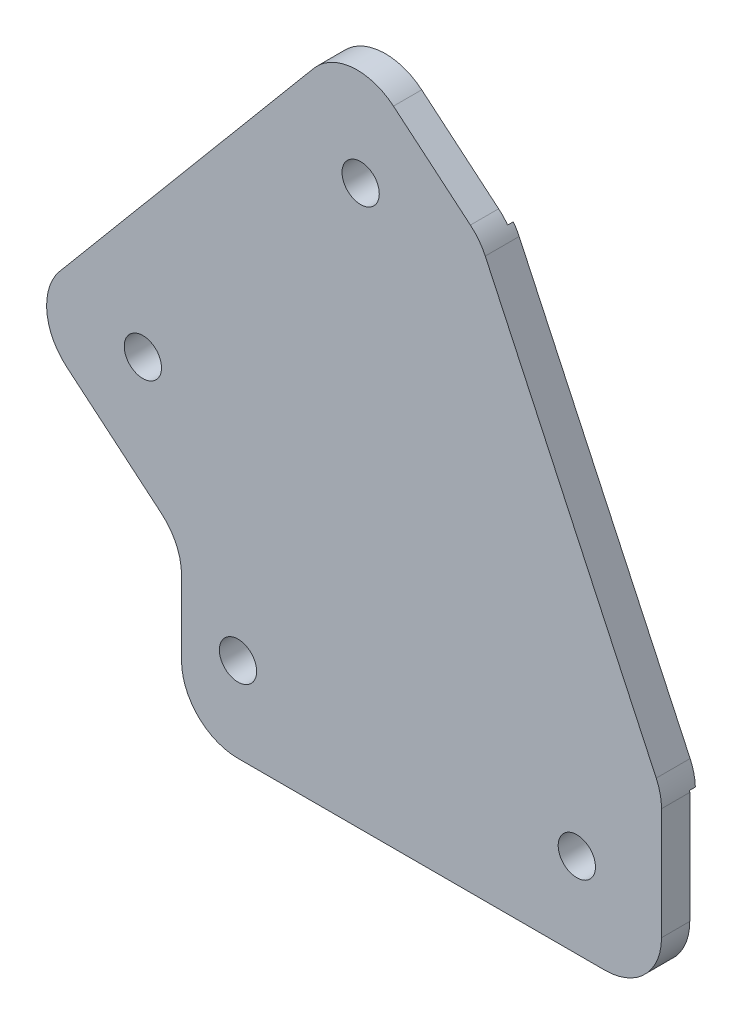
ISO-10303-21;
HEADER;
FILE_DESCRIPTION(('STEP AP214'),'2;1');
FILE_NAME('part.step','',(''),(''),'','','');
FILE_SCHEMA(('AUTOMOTIVE_DESIGN { 1 0 10303 214 1 1 1 1 }'));
ENDSEC;
DATA;
#1=APPLICATION_CONTEXT('core data for automotive mechanical design processes');
#2=APPLICATION_PROTOCOL_DEFINITION('international standard','automotive_design',2000,#1);
#3=PRODUCT_CONTEXT('',#1,'mechanical');
#4=PRODUCT('Part','Part','',(#3));
#5=PRODUCT_RELATED_PRODUCT_CATEGORY('part','',(#4));
#6=PRODUCT_DEFINITION_FORMATION('','',#4);
#7=PRODUCT_DEFINITION_CONTEXT('part definition',#1,'design');
#8=PRODUCT_DEFINITION('design','',#6,#7);
#9=PRODUCT_DEFINITION_SHAPE('','',#8);
#10=(LENGTH_UNIT() NAMED_UNIT(*) SI_UNIT(.MILLI.,.METRE.));
#11=(NAMED_UNIT(*) PLANE_ANGLE_UNIT() SI_UNIT($,.RADIAN.));
#12=(NAMED_UNIT(*) SI_UNIT($,.STERADIAN.) SOLID_ANGLE_UNIT());
#13=UNCERTAINTY_MEASURE_WITH_UNIT(LENGTH_MEASURE(1.E-05),#10,'distance_accuracy_value','');
#14=(GEOMETRIC_REPRESENTATION_CONTEXT(3) GLOBAL_UNCERTAINTY_ASSIGNED_CONTEXT((#13)) GLOBAL_UNIT_ASSIGNED_CONTEXT((#10,
#11,#12)) REPRESENTATION_CONTEXT('',''));
#15=CARTESIAN_POINT('',(0.,0.,0.));
#16=DIRECTION('',(0.,0.,1.));
#17=DIRECTION('',(1.,0.,0.));
#18=AXIS2_PLACEMENT_3D('',#15,#16,#17);
#19=CARTESIAN_POINT('',(0.,0.,-3.));
#20=DIRECTION('',(0.642787609686543,0.766044443118975,0.));
#21=DIRECTION('',(-0.766044443118975,0.642787609686543,0.));
#22=AXIS2_PLACEMENT_3D('',#19,#20,#21);
#23=PLANE('',#22);
#24=DIRECTION('',(0.766044443118975,-0.642787609686543,0.));
#25=VECTOR('',#24,1.);
#26=CARTESIAN_POINT('',(0.,0.,-3.));
#27=LINE('',#26,#25);
#28=CARTESIAN_POINT('',(0.038302222155933,-0.032139380484332,-3.));
#29=VERTEX_POINT('',#28);
#30=CARTESIAN_POINT('',(0.713938048432714,-0.599065153123323,-3.));
#31=VERTEX_POINT('',#30);
#32=EDGE_CURVE('E261',#29,#31,#27,.T.);
#33=ORIENTED_EDGE('',*,*,#32,.T.);
#34=DIRECTION('',(0.,0.,1.));
#35=VECTOR('',#34,1.);
#36=CARTESIAN_POINT('',(0.713938048432714,-0.599065153123323,-3.));
#37=LINE('',#36,#35);
#38=CARTESIAN_POINT('',(0.713938048432714,-0.599065153123323,0.));
#39=VERTEX_POINT('',#38);
#40=EDGE_CURVE('E214',#39,#31,#37,.F.);
#41=ORIENTED_EDGE('',*,*,#40,.F.);
#42=DIRECTION('',(0.766044443118975,-0.642787609686543,0.));
#43=VECTOR('',#42,1.);
#44=CARTESIAN_POINT('',(0.,0.,0.));
#45=LINE('',#44,#43);
#46=CARTESIAN_POINT('',(-7.66044443118975,6.42787609686543,0.));
#47=VERTEX_POINT('',#46);
#48=EDGE_CURVE('E301',#47,#39,#45,.T.);
#49=ORIENTED_EDGE('',*,*,#48,.F.);
#50=DIRECTION('',(0.,0.,1.));
#51=VECTOR('',#50,1.);
#52=CARTESIAN_POINT('',(-7.66044443118975,6.42787609686543,-3.));
#53=LINE('',#52,#51);
#54=CARTESIAN_POINT('',(-7.66044443118975,6.42787609686543,-2.5));
#55=VERTEX_POINT('',#54);
#56=EDGE_CURVE('E217',#55,#47,#53,.T.);
#57=ORIENTED_EDGE('',*,*,#56,.F.);
#58=DIRECTION('',(-0.766044443118975,0.642787609686543,0.));
#59=VECTOR('',#58,1.);
#60=CARTESIAN_POINT('',(0.,0.,-2.5));
#61=LINE('',#60,#59);
#62=CARTESIAN_POINT('',(0.0383022221559434,-0.0321393804843154,-2.5));
#63=VERTEX_POINT('',#62);
#64=EDGE_CURVE('E328',#63,#55,#61,.T.);
#65=ORIENTED_EDGE('',*,*,#64,.F.);
#66=DIRECTION('',(0.,0.,1.));
#67=VECTOR('',#66,1.);
#68=CARTESIAN_POINT('',(0.0383022221559392,-0.0321393804843191,-3.));
#69=LINE('',#68,#67);
#70=EDGE_CURVE('E313',#29,#63,#69,.T.);
#71=ORIENTED_EDGE('',*,*,#70,.F.);
#72=EDGE_LOOP('',(#33,#41,#49,#57,#65,#71));
#73=FACE_BOUND('',#72,.T.);
#74=ADVANCED_FACE('F43',(#73),#23,.F.);
#75=CARTESIAN_POINT('',(2.5,0.,-3.));
#76=DIRECTION('',(1.,0.,0.));
#77=DIRECTION('',(0.,1.,0.));
#78=AXIS2_PLACEMENT_3D('',#75,#76,#77);
#79=PLANE('',#78);
#80=DIRECTION('',(0.,0.,1.));
#81=VECTOR('',#80,1.);
#82=CARTESIAN_POINT('',(2.5,-11.,-3.));
#83=LINE('',#82,#81);
#84=CARTESIAN_POINT('',(2.5,-11.,0.));
#85=VERTEX_POINT('',#84);
#86=CARTESIAN_POINT('',(2.5,-11.,-2.5));
#87=VERTEX_POINT('',#86);
#88=EDGE_CURVE('E229',#85,#87,#83,.F.);
#89=ORIENTED_EDGE('',*,*,#88,.F.);
#90=DIRECTION('',(0.,-1.,0.));
#91=VECTOR('',#90,1.);
#92=CARTESIAN_POINT('',(2.5,0.,0.));
#93=LINE('',#92,#91);
#94=CARTESIAN_POINT('',(2.5,-4.4292873687182,0.));
#95=VERTEX_POINT('',#94);
#96=EDGE_CURVE('E298',#95,#85,#93,.T.);
#97=ORIENTED_EDGE('',*,*,#96,.F.);
#98=DIRECTION('',(0.,0.,1.));
#99=VECTOR('',#98,1.);
#100=CARTESIAN_POINT('',(2.5,-4.4292873687182,0.));
#101=LINE('',#100,#99);
#102=CARTESIAN_POINT('',(2.5,-4.4292873687182,-2.5));
#103=VERTEX_POINT('',#102);
#104=EDGE_CURVE('E226',#103,#95,#101,.T.);
#105=ORIENTED_EDGE('',*,*,#104,.F.);
#106=DIRECTION('',(0.,1.,0.));
#107=VECTOR('',#106,1.);
#108=CARTESIAN_POINT('',(2.5,0.,-2.5));
#109=LINE('',#108,#107);
#110=EDGE_CURVE('E341',#87,#103,#109,.T.);
#111=ORIENTED_EDGE('',*,*,#110,.F.);
#112=EDGE_LOOP('',(#89,#97,#105,#111));
#113=FACE_BOUND('',#112,.T.);
#114=ADVANCED_FACE('F376',(#113),#79,.F.);
#115=CARTESIAN_POINT('',(0.,-16.,-3.));
#116=DIRECTION('',(0.,1.,0.));
#117=DIRECTION('',(0.,0.,-1.));
#118=AXIS2_PLACEMENT_3D('',#115,#116,#117);
#119=PLANE('',#118);
#120=DIRECTION('',(0.,0.,1.));
#121=VECTOR('',#120,1.);
#122=CARTESIAN_POINT('',(40.,-16.,-3.));
#123=LINE('',#122,#121);
#124=CARTESIAN_POINT('',(40.,-16.,0.));
#125=VERTEX_POINT('',#124);
#126=CARTESIAN_POINT('',(40.,-16.,-2.5));
#127=VERTEX_POINT('',#126);
#128=EDGE_CURVE('E211',#125,#127,#123,.F.);
#129=ORIENTED_EDGE('',*,*,#128,.F.);
#130=DIRECTION('',(1.,0.,0.));
#131=VECTOR('',#130,1.);
#132=CARTESIAN_POINT('',(0.,-16.,0.));
#133=LINE('',#132,#131);
#134=CARTESIAN_POINT('',(7.5,-16.,0.));
#135=VERTEX_POINT('',#134);
#136=EDGE_CURVE('E293',#135,#125,#133,.T.);
#137=ORIENTED_EDGE('',*,*,#136,.F.);
#138=DIRECTION('',(0.,0.,1.));
#139=VECTOR('',#138,1.);
#140=CARTESIAN_POINT('',(7.5,-16.,-3.));
#141=LINE('',#140,#139);
#142=CARTESIAN_POINT('',(7.5,-16.,-2.5));
#143=VERTEX_POINT('',#142);
#144=EDGE_CURVE('E208',#143,#135,#141,.T.);
#145=ORIENTED_EDGE('',*,*,#144,.F.);
#146=DIRECTION('',(1.,0.,0.));
#147=VECTOR('',#146,1.);
#148=CARTESIAN_POINT('',(0.5,-16.,-2.5));
#149=LINE('',#148,#147);
#150=EDGE_CURVE('E186',#143,#127,#149,.T.);
#151=ORIENTED_EDGE('',*,*,#150,.T.);
#152=EDGE_LOOP('',(#129,#137,#145,#151));
#153=FACE_BOUND('',#152,.T.);
#154=ADVANCED_FACE('F384',(#153),#119,.F.);
#155=CARTESIAN_POINT('',(45.,0.,-3.));
#156=DIRECTION('',(-1.,0.,0.));
#157=DIRECTION('',(0.,0.,-1.));
#158=AXIS2_PLACEMENT_3D('',#155,#156,#157);
#159=PLANE('',#158);
#160=DIRECTION('',(0.,0.,1.));
#161=VECTOR('',#160,1.);
#162=CARTESIAN_POINT('',(45.,-1.10847331321474,-3.));
#163=LINE('',#162,#161);
#164=CARTESIAN_POINT('',(45.,-1.10847331321474,0.));
#165=VERTEX_POINT('',#164);
#166=CARTESIAN_POINT('',(45.,-1.10847331321474,-2.5));
#167=VERTEX_POINT('',#166);
#168=EDGE_CURVE('E206',#165,#167,#163,.F.);
#169=ORIENTED_EDGE('',*,*,#168,.F.);
#170=DIRECTION('',(0.,1.,0.));
#171=VECTOR('',#170,1.);
#172=CARTESIAN_POINT('',(45.,0.,0.));
#173=LINE('',#172,#171);
#174=CARTESIAN_POINT('',(45.,-11.,0.));
#175=VERTEX_POINT('',#174);
#176=EDGE_CURVE('E292',#175,#165,#173,.T.);
#177=ORIENTED_EDGE('',*,*,#176,.F.);
#178=DIRECTION('',(0.,0.,1.));
#179=VECTOR('',#178,1.);
#180=CARTESIAN_POINT('',(45.,-11.,-3.));
#181=LINE('',#180,#179);
#182=CARTESIAN_POINT('',(45.,-11.,-2.5));
#183=VERTEX_POINT('',#182);
#184=EDGE_CURVE('E197',#183,#175,#181,.T.);
#185=ORIENTED_EDGE('',*,*,#184,.F.);
#186=DIRECTION('',(0.,1.,0.));
#187=VECTOR('',#186,1.);
#188=CARTESIAN_POINT('',(45.,-16.,-2.5));
#189=LINE('',#188,#187);
#190=EDGE_CURVE('E346',#183,#167,#189,.T.);
#191=ORIENTED_EDGE('',*,*,#190,.T.);
#192=EDGE_LOOP('',(#169,#177,#185,#191));
#193=FACE_BOUND('',#192,.T.);
#194=ADVANCED_FACE('F392',(#193),#159,.F.);
#195=CARTESIAN_POINT('',(36.9627212179472,17.2359999701769,-3.));
#196=DIRECTION('',(-0.906307787036651,-0.422618261740697,0.));
#197=DIRECTION('',(0.422618261740697,-0.906307787036651,0.));
#198=AXIS2_PLACEMENT_3D('',#195,#196,#197);
#199=PLANE('',#198);
#200=DIRECTION('',(-0.422618261740697,0.906307787036651,0.));
#201=VECTOR('',#200,1.);
#202=CARTESIAN_POINT('',(36.9627212179472,17.2359999701769,0.));
#203=LINE('',#202,#201);
#204=CARTESIAN_POINT('',(44.5315389351833,1.00461799548874,0.));
#205=VERTEX_POINT('',#204);
#206=CARTESIAN_POINT('',(29.3939035007112,33.4673819448651,0.));
#207=VERTEX_POINT('',#206);
#208=EDGE_CURVE('E267',#205,#207,#203,.T.);
#209=ORIENTED_EDGE('',*,*,#208,.F.);
#210=DIRECTION('',(0.,0.,1.));
#211=VECTOR('',#210,1.);
#212=CARTESIAN_POINT('',(44.5315389351833,1.00461799548874,-3.));
#213=LINE('',#212,#211);
#214=CARTESIAN_POINT('',(44.5315389351833,1.00461799548874,-3.));
#215=VERTEX_POINT('',#214);
#216=EDGE_CURVE('E200',#215,#205,#213,.T.);
#217=ORIENTED_EDGE('',*,*,#216,.F.);
#218=DIRECTION('',(-0.422618261740697,0.906307787036651,0.));
#219=VECTOR('',#218,1.);
#220=CARTESIAN_POINT('',(36.9627212179472,17.2359999701769,-3.));
#221=LINE('',#220,#219);
#222=CARTESIAN_POINT('',(29.3939035007112,33.4673819448651,-3.));
#223=VERTEX_POINT('',#222);
#224=EDGE_CURVE('E191',#215,#223,#221,.T.);
#225=ORIENTED_EDGE('',*,*,#224,.T.);
#226=DIRECTION('',(0.,0.,1.));
#227=VECTOR('',#226,1.);
#228=CARTESIAN_POINT('',(29.3939035007112,33.4673819448651,-3.));
#229=LINE('',#228,#227);
#230=EDGE_CURVE('E194',#207,#223,#229,.F.);
#231=ORIENTED_EDGE('',*,*,#230,.F.);
#232=EDGE_LOOP('',(#209,#217,#225,#231));
#233=FACE_BOUND('',#232,.T.);
#234=ADVANCED_FACE('F291',(#233),#199,.F.);
#235=CARTESIAN_POINT('',(28.9254424358944,34.4719999403539,-3.));
#236=DIRECTION('',(-0.642787609686543,-0.766044443118975,0.));
#237=DIRECTION('',(0.766044443118975,-0.642787609686543,0.));
#238=AXIS2_PLACEMENT_3D('',#235,#236,#237);
#239=PLANE('',#238);
#240=DIRECTION('',(0.,0.,1.));
#241=VECTOR('',#240,1.);
#242=CARTESIAN_POINT('',(21.2649980047047,40.8998760372193,-3.));
#243=LINE('',#242,#241);
#244=CARTESIAN_POINT('',(21.2649980047047,40.8998760372193,0.));
#245=VERTEX_POINT('',#244);
#246=CARTESIAN_POINT('',(21.2649980047047,40.8998760372193,-2.5));
#247=VERTEX_POINT('',#246);
#248=EDGE_CURVE('E245',#245,#247,#243,.F.);
#249=ORIENTED_EDGE('',*,*,#248,.F.);
#250=DIRECTION('',(-0.766044443118975,0.642787609686543,0.));
#251=VECTOR('',#250,1.);
#252=CARTESIAN_POINT('',(28.9254424358944,34.4719999403539,0.));
#253=LINE('',#252,#251);
#254=CARTESIAN_POINT('',(28.0763026139607,35.1845128517564,0.));
#255=VERTEX_POINT('',#254);
#256=EDGE_CURVE('E262',#255,#245,#253,.T.);
#257=ORIENTED_EDGE('',*,*,#256,.F.);
#258=DIRECTION('',(0.,0.,1.));
#259=VECTOR('',#258,1.);
#260=CARTESIAN_POINT('',(28.0763026139607,35.1845128517564,-3.));
#261=LINE('',#260,#259);
#262=CARTESIAN_POINT('',(28.0763026139607,35.1845128517564,-2.5));
#263=VERTEX_POINT('',#262);
#264=EDGE_CURVE('E272',#263,#255,#261,.T.);
#265=ORIENTED_EDGE('',*,*,#264,.F.);
#266=DIRECTION('',(-0.766044443118974,0.642787609686543,0.));
#267=VECTOR('',#266,1.);
#268=CARTESIAN_POINT('',(17.4347757891098,44.113814085652,-2.5));
#269=LINE('',#268,#267);
#270=EDGE_CURVE('E255',#263,#247,#269,.T.);
#271=ORIENTED_EDGE('',*,*,#270,.T.);
#272=EDGE_LOOP('',(#249,#257,#265,#271));
#273=FACE_BOUND('',#272,.T.);
#274=ADVANCED_FACE('F354',(#273),#239,.F.);
#275=CARTESIAN_POINT('',(-11.4906666467846,9.64181414529815,-3.));
#276=DIRECTION('',(0.766044443118975,-0.642787609686543,0.));
#277=DIRECTION('',(0.642787609686543,0.766044443118975,0.));
#278=AXIS2_PLACEMENT_3D('',#275,#276,#277);
#279=PLANE('',#278);
#280=DIRECTION('',(0.,0.,1.));
#281=VECTOR('',#280,1.);
#282=CARTESIAN_POINT('',(-8.27672859835191,13.472036360893,-3.));
#283=LINE('',#282,#281);
#284=CARTESIAN_POINT('',(-8.27672859835191,13.472036360893,0.));
#285=VERTEX_POINT('',#284);
#286=CARTESIAN_POINT('',(-8.27672859835191,13.472036360893,-2.5));
#287=VERTEX_POINT('',#286);
#288=EDGE_CURVE('E223',#285,#287,#283,.F.);
#289=ORIENTED_EDGE('',*,*,#288,.F.);
#290=DIRECTION('',(-0.642787609686543,-0.766044443118975,0.));
#291=VECTOR('',#290,1.);
#292=CARTESIAN_POINT('',(-11.4906666467846,9.64181414529815,0.));
#293=LINE('',#292,#291);
#294=CARTESIAN_POINT('',(14.2208377406771,40.2835918700571,0.));
#295=VERTEX_POINT('',#294);
#296=EDGE_CURVE('E259',#295,#285,#293,.T.);
#297=ORIENTED_EDGE('',*,*,#296,.F.);
#298=DIRECTION('',(0.,0.,1.));
#299=VECTOR('',#298,1.);
#300=CARTESIAN_POINT('',(14.2208377406771,40.2835918700571,-3.));
#301=LINE('',#300,#299);
#302=CARTESIAN_POINT('',(14.2208377406771,40.2835918700571,-2.5));
#303=VERTEX_POINT('',#302);
#304=EDGE_CURVE('E220',#303,#295,#301,.T.);
#305=ORIENTED_EDGE('',*,*,#304,.F.);
#306=DIRECTION('',(-0.642787609686543,-0.766044443118975,0.));
#307=VECTOR('',#306,1.);
#308=CARTESIAN_POINT('',(17.4347757891098,44.113814085652,-2.5));
#309=LINE('',#308,#307);
#310=EDGE_CURVE('E247',#303,#287,#309,.T.);
#311=ORIENTED_EDGE('',*,*,#310,.T.);
#312=EDGE_LOOP('',(#289,#297,#305,#311));
#313=FACE_BOUND('',#312,.T.);
#314=ADVANCED_FACE('F257',(#313),#279,.F.);
#315=CARTESIAN_POINT('',(0.,0.,-3.));
#316=DIRECTION('',(0.,0.,-1.));
#317=DIRECTION('',(1.,0.,0.));
#318=AXIS2_PLACEMENT_3D('',#315,#316,#317);
#319=PLANE('',#318);
#320=DIRECTION('',(0.642787609686543,0.766044443118975,0.));
#321=VECTOR('',#320,1.);
#322=CARTESIAN_POINT('',(28.9637446580504,34.4398605598695,-3.));
#323=LINE('',#322,#321);
#324=CARTESIAN_POINT('',(28.8762887770626,34.3356346995088,-3.));
#325=VERTEX_POINT('',#324);
#326=EDGE_CURVE('E185',#29,#325,#323,.T.);
#327=ORIENTED_EDGE('',*,*,#326,.T.);
#328=CARTESIAN_POINT('',(24.8623645655279,31.3542906361616,-3.));
#329=DIRECTION('',(0.,0.,1.));
#330=DIRECTION('',(1.,0.,0.));
#331=AXIS2_PLACEMENT_3D('',#328,#329,#330);
#332=CIRCLE('',#331,5.);
#333=EDGE_CURVE('E193',#223,#325,#332,.T.);
#334=ORIENTED_EDGE('',*,*,#333,.F.);
#335=ORIENTED_EDGE('',*,*,#224,.F.);
#336=CARTESIAN_POINT('',(40.,-1.10847331321474,-3.));
#337=DIRECTION('',(0.,0.,1.));
#338=DIRECTION('',(1.,0.,0.));
#339=AXIS2_PLACEMENT_3D('',#336,#337,#338);
#340=CIRCLE('',#339,5.);
#341=CARTESIAN_POINT('',(44.9974879898804,-0.95,-3.));
#342=VERTEX_POINT('',#341);
#343=EDGE_CURVE('E172',#342,#215,#340,.T.);
#344=ORIENTED_EDGE('',*,*,#343,.F.);
#345=DIRECTION('',(-1.,0.,0.));
#346=VECTOR('',#345,1.);
#347=CARTESIAN_POINT('',(0.499999999999997,-0.950000000000002,-3.));
#348=LINE('',#347,#346);
#349=CARTESIAN_POINT('',(1.0908995260071,-0.950000000000002,-3.));
#350=VERTEX_POINT('',#349);
#351=EDGE_CURVE('E180',#342,#350,#348,.T.);
#352=ORIENTED_EDGE('',*,*,#351,.T.);
#353=CARTESIAN_POINT('',(-2.5,-4.4292873687182,-3.));
#354=DIRECTION('',(0.,0.,1.));
#355=DIRECTION('',(1.,0.,0.));
#356=AXIS2_PLACEMENT_3D('',#353,#354,#355);
#357=CIRCLE('',#356,5.);
#358=EDGE_CURVE('E234',#31,#350,#357,.F.);
#359=ORIENTED_EDGE('',*,*,#358,.F.);
#360=ORIENTED_EDGE('',*,*,#32,.F.);
#361=EDGE_LOOP('',(#327,#334,#335,#344,#352,#359,#360));
#362=FACE_BOUND('',#361,.T.);
#363=ADVANCED_FACE('F189',(#362),#319,.T.);
#364=CARTESIAN_POINT('',(0.,0.,0.));
#365=DIRECTION('',(0.,0.,-1.));
#366=DIRECTION('',(1.,0.,0.));
#367=AXIS2_PLACEMENT_3D('',#364,#365,#366);
#368=PLANE('',#367);
#369=CARTESIAN_POINT('',(37.5,-8.5,0.));
#370=DIRECTION('',(0.,0.,1.));
#371=DIRECTION('',(1.,0.,0.));
#372=AXIS2_PLACEMENT_3D('',#369,#370,#371);
#373=CIRCLE('',#372,1.65);
#374=CARTESIAN_POINT('',(39.15,-8.5,0.));
#375=VERTEX_POINT('',#374);
#376=EDGE_CURVE('E309',#375,#375,#373,.T.);
#377=ORIENTED_EDGE('',*,*,#376,.F.);
#378=EDGE_LOOP('',(#377));
#379=FACE_BOUND('',#378,.T.);
#380=CARTESIAN_POINT('',(18.359202039853,33.5475736896106,0.));
#381=DIRECTION('',(0.,0.,1.));
#382=DIRECTION('',(1.,0.,0.));
#383=AXIS2_PLACEMENT_3D('',#380,#381,#382);
#384=CIRCLE('',#383,1.65);
#385=CARTESIAN_POINT('',(20.009202039853,33.5475736896106,0.));
#386=VERTEX_POINT('',#385);
#387=EDGE_CURVE('E312',#386,#386,#384,.T.);
#388=ORIENTED_EDGE('',*,*,#387,.F.);
#389=EDGE_LOOP('',(#388));
#390=FACE_BOUND('',#389,.T.);
#391=CARTESIAN_POINT('',(-0.924426250743252,10.5662403960414,0.));
#392=DIRECTION('',(0.,0.,1.));
#393=DIRECTION('',(1.,0.,0.));
#394=AXIS2_PLACEMENT_3D('',#391,#392,#393);
#395=CIRCLE('',#394,1.65);
#396=CARTESIAN_POINT('',(0.725573749256749,10.5662403960414,0.));
#397=VERTEX_POINT('',#396);
#398=EDGE_CURVE('E308',#397,#397,#395,.T.);
#399=ORIENTED_EDGE('',*,*,#398,.F.);
#400=EDGE_LOOP('',(#399));
#401=FACE_BOUND('',#400,.T.);
#402=CARTESIAN_POINT('',(7.5,-8.5,0.));
#403=DIRECTION('',(0.,0.,1.));
#404=DIRECTION('',(1.,0.,0.));
#405=AXIS2_PLACEMENT_3D('',#402,#403,#404);
#406=CIRCLE('',#405,1.65);
#407=CARTESIAN_POINT('',(9.15,-8.5,0.));
#408=VERTEX_POINT('',#407);
#409=EDGE_CURVE('E304',#408,#408,#406,.T.);
#410=ORIENTED_EDGE('',*,*,#409,.F.);
#411=EDGE_LOOP('',(#410));
#412=FACE_BOUND('',#411,.T.);
#413=ORIENTED_EDGE('',*,*,#256,.T.);
#414=CARTESIAN_POINT('',(18.051059956272,37.0696538216244,0.));
#415=DIRECTION('',(0.,0.,1.));
#416=DIRECTION('',(1.,0.,0.));
#417=AXIS2_PLACEMENT_3D('',#414,#415,#416);
#418=CIRCLE('',#417,5.);
#419=EDGE_CURVE('E277',#295,#245,#418,.F.);
#420=ORIENTED_EDGE('',*,*,#419,.F.);
#421=ORIENTED_EDGE('',*,*,#296,.T.);
#422=CARTESIAN_POINT('',(-4.44650638275704,10.2580983124603,0.));
#423=DIRECTION('',(0.,0.,1.));
#424=DIRECTION('',(1.,0.,0.));
#425=AXIS2_PLACEMENT_3D('',#422,#423,#424);
#426=CIRCLE('',#425,5.);
#427=EDGE_CURVE('E279',#47,#285,#426,.F.);
#428=ORIENTED_EDGE('',*,*,#427,.F.);
#429=ORIENTED_EDGE('',*,*,#48,.T.);
#430=CARTESIAN_POINT('',(-2.5,-4.4292873687182,0.));
#431=DIRECTION('',(0.,0.,1.));
#432=DIRECTION('',(1.,0.,0.));
#433=AXIS2_PLACEMENT_3D('',#430,#431,#432);
#434=CIRCLE('',#433,5.);
#435=EDGE_CURVE('E232',#95,#39,#434,.T.);
#436=ORIENTED_EDGE('',*,*,#435,.F.);
#437=ORIENTED_EDGE('',*,*,#96,.T.);
#438=CARTESIAN_POINT('',(7.5,-11.,0.));
#439=DIRECTION('',(0.,0.,1.));
#440=DIRECTION('',(1.,0.,0.));
#441=AXIS2_PLACEMENT_3D('',#438,#439,#440);
#442=CIRCLE('',#441,5.);
#443=EDGE_CURVE('E275',#135,#85,#442,.F.);
#444=ORIENTED_EDGE('',*,*,#443,.F.);
#445=ORIENTED_EDGE('',*,*,#136,.T.);
#446=CARTESIAN_POINT('',(40.,-11.,0.));
#447=DIRECTION('',(0.,0.,1.));
#448=DIRECTION('',(1.,0.,0.));
#449=AXIS2_PLACEMENT_3D('',#446,#447,#448);
#450=CIRCLE('',#449,5.);
#451=EDGE_CURVE('E281',#175,#125,#450,.F.);
#452=ORIENTED_EDGE('',*,*,#451,.F.);
#453=ORIENTED_EDGE('',*,*,#176,.T.);
#454=CARTESIAN_POINT('',(40.,-1.10847331321474,0.));
#455=DIRECTION('',(0.,0.,1.));
#456=DIRECTION('',(1.,0.,0.));
#457=AXIS2_PLACEMENT_3D('',#454,#455,#456);
#458=CIRCLE('',#457,5.);
#459=EDGE_CURVE('E283',#205,#165,#458,.F.);
#460=ORIENTED_EDGE('',*,*,#459,.F.);
#461=ORIENTED_EDGE('',*,*,#208,.T.);
#462=CARTESIAN_POINT('',(24.8623645655279,31.3542906361616,0.));
#463=DIRECTION('',(0.,0.,1.));
#464=DIRECTION('',(1.,0.,0.));
#465=AXIS2_PLACEMENT_3D('',#462,#463,#464);
#466=CIRCLE('',#465,5.);
#467=EDGE_CURVE('E285',#255,#207,#466,.F.);
#468=ORIENTED_EDGE('',*,*,#467,.F.);
#469=EDGE_LOOP('',(#413,#420,#421,#428,#429,#436,#437,#444,#445,#452,#453,#460,#461,#468));
#470=FACE_BOUND('',#469,.T.);
#471=ADVANCED_FACE('F369',(#379,#390,#401,#412,#470),#368,.F.);
#472=CARTESIAN_POINT('',(7.5,-8.5,0.));
#473=DIRECTION('',(0.,0.,-1.));
#474=DIRECTION('',(1.,0.,0.));
#475=AXIS2_PLACEMENT_3D('',#472,#473,#474);
#476=CYLINDRICAL_SURFACE('',#475,1.65);
#477=CARTESIAN_POINT('',(7.5,-8.5,-2.5));
#478=DIRECTION('',(0.,0.,-1.));
#479=DIRECTION('',(-1.,0.,0.));
#480=AXIS2_PLACEMENT_3D('',#477,#478,#479);
#481=CIRCLE('',#480,1.65);
#482=CARTESIAN_POINT('',(5.85,-8.5,-2.5));
#483=VERTEX_POINT('',#482);
#484=EDGE_CURVE('E177',#483,#483,#481,.F.);
#485=ORIENTED_EDGE('',*,*,#484,.F.);
#486=EDGE_LOOP('',(#485));
#487=FACE_BOUND('',#486,.T.);
#488=ORIENTED_EDGE('',*,*,#409,.T.);
#489=EDGE_LOOP('',(#488));
#490=FACE_BOUND('',#489,.T.);
#491=ADVANCED_FACE('F401',(#487,#490),#476,.F.);
#492=CARTESIAN_POINT('',(-0.924426250743252,10.5662403960414,0.));
#493=DIRECTION('',(0.,0.,-1.));
#494=DIRECTION('',(1.,0.,0.));
#495=AXIS2_PLACEMENT_3D('',#492,#493,#494);
#496=CYLINDRICAL_SURFACE('',#495,1.65);
#497=CARTESIAN_POINT('',(-0.924426250743252,10.5662403960414,-2.5));
#498=DIRECTION('',(0.,0.,-1.));
#499=DIRECTION('',(-1.,0.,0.));
#500=AXIS2_PLACEMENT_3D('',#497,#498,#499);
#501=CIRCLE('',#500,1.65);
#502=CARTESIAN_POINT('',(-2.57442625074325,10.5662403960414,-2.5));
#503=VERTEX_POINT('',#502);
#504=EDGE_CURVE('E320',#503,#503,#501,.F.);
#505=ORIENTED_EDGE('',*,*,#504,.F.);
#506=EDGE_LOOP('',(#505));
#507=FACE_BOUND('',#506,.T.);
#508=ORIENTED_EDGE('',*,*,#398,.T.);
#509=EDGE_LOOP('',(#508));
#510=FACE_BOUND('',#509,.T.);
#511=ADVANCED_FACE('F404',(#507,#510),#496,.F.);
#512=CARTESIAN_POINT('',(18.359202039853,33.5475736896106,0.));
#513=DIRECTION('',(0.,0.,-1.));
#514=DIRECTION('',(1.,0.,0.));
#515=AXIS2_PLACEMENT_3D('',#512,#513,#514);
#516=CYLINDRICAL_SURFACE('',#515,1.65);
#517=CARTESIAN_POINT('',(18.359202039853,33.5475736896106,-2.5));
#518=DIRECTION('',(0.,0.,-1.));
#519=DIRECTION('',(-1.,0.,0.));
#520=AXIS2_PLACEMENT_3D('',#517,#518,#519);
#521=CIRCLE('',#520,1.65);
#522=CARTESIAN_POINT('',(16.709202039853,33.5475736896106,-2.5));
#523=VERTEX_POINT('',#522);
#524=EDGE_CURVE('E323',#523,#523,#521,.F.);
#525=ORIENTED_EDGE('',*,*,#524,.F.);
#526=EDGE_LOOP('',(#525));
#527=FACE_BOUND('',#526,.T.);
#528=ORIENTED_EDGE('',*,*,#387,.T.);
#529=EDGE_LOOP('',(#528));
#530=FACE_BOUND('',#529,.T.);
#531=ADVANCED_FACE('F451',(#527,#530),#516,.F.);
#532=CARTESIAN_POINT('',(37.5,-8.5,0.));
#533=DIRECTION('',(0.,0.,-1.));
#534=DIRECTION('',(1.,0.,0.));
#535=AXIS2_PLACEMENT_3D('',#532,#533,#534);
#536=CYLINDRICAL_SURFACE('',#535,1.65);
#537=CARTESIAN_POINT('',(37.5,-8.5,-2.5));
#538=DIRECTION('',(0.,0.,-1.));
#539=DIRECTION('',(-1.,0.,0.));
#540=AXIS2_PLACEMENT_3D('',#537,#538,#539);
#541=CIRCLE('',#540,1.65);
#542=CARTESIAN_POINT('',(35.85,-8.5,-2.5));
#543=VERTEX_POINT('',#542);
#544=EDGE_CURVE('E333',#543,#543,#541,.F.);
#545=ORIENTED_EDGE('',*,*,#544,.F.);
#546=EDGE_LOOP('',(#545));
#547=FACE_BOUND('',#546,.T.);
#548=ORIENTED_EDGE('',*,*,#376,.T.);
#549=EDGE_LOOP('',(#548));
#550=FACE_BOUND('',#549,.T.);
#551=ADVANCED_FACE('F428',(#547,#550),#536,.F.);
#552=CARTESIAN_POINT('',(24.8623645655279,31.3542906361616,-3.));
#553=DIRECTION('',(0.,0.,1.));
#554=DIRECTION('',(-1.,0.,0.));
#555=AXIS2_PLACEMENT_3D('',#552,#553,#554);
#556=CYLINDRICAL_SURFACE('',#555,5.);
#557=DIRECTION('',(0.,0.,1.));
#558=VECTOR('',#557,1.);
#559=CARTESIAN_POINT('',(28.8762887770626,34.3356346995088,-3.));
#560=LINE('',#559,#558);
#561=CARTESIAN_POINT('',(28.8762887770626,34.3356346995088,-2.5));
#562=VERTEX_POINT('',#561);
#563=EDGE_CURVE('E11',#325,#562,#560,.T.);
#564=ORIENTED_EDGE('',*,*,#563,.T.);
#565=CARTESIAN_POINT('',(24.8623645655279,31.3542906361616,-2.5));
#566=DIRECTION('',(0.,0.,-1.));
#567=DIRECTION('',(-1.,0.,0.));
#568=AXIS2_PLACEMENT_3D('',#565,#566,#567);
#569=CIRCLE('',#568,5.);
#570=EDGE_CURVE('E326',#562,#263,#569,.F.);
#571=ORIENTED_EDGE('',*,*,#570,.T.);
#572=ORIENTED_EDGE('',*,*,#264,.T.);
#573=ORIENTED_EDGE('',*,*,#467,.T.);
#574=ORIENTED_EDGE('',*,*,#230,.T.);
#575=ORIENTED_EDGE('',*,*,#333,.T.);
#576=EDGE_LOOP('',(#564,#571,#572,#573,#574,#575));
#577=FACE_BOUND('',#576,.T.);
#578=ADVANCED_FACE('F357',(#577),#556,.T.);
#579=CARTESIAN_POINT('',(40.,-1.10847331321474,-3.));
#580=DIRECTION('',(0.,0.,1.));
#581=DIRECTION('',(-1.,0.,0.));
#582=AXIS2_PLACEMENT_3D('',#579,#580,#581);
#583=CYLINDRICAL_SURFACE('',#582,5.);
#584=DIRECTION('',(0.,0.,1.));
#585=VECTOR('',#584,1.);
#586=CARTESIAN_POINT('',(44.9974879898804,-0.95,-3.));
#587=LINE('',#586,#585);
#588=CARTESIAN_POINT('',(44.9974879898804,-0.95,-2.5));
#589=VERTEX_POINT('',#588);
#590=EDGE_CURVE('E167',#589,#342,#587,.F.);
#591=ORIENTED_EDGE('',*,*,#590,.T.);
#592=ORIENTED_EDGE('',*,*,#343,.T.);
#593=ORIENTED_EDGE('',*,*,#216,.T.);
#594=ORIENTED_EDGE('',*,*,#459,.T.);
#595=ORIENTED_EDGE('',*,*,#168,.T.);
#596=CARTESIAN_POINT('',(40.,-1.10847331321474,-2.5));
#597=DIRECTION('',(0.,0.,-1.));
#598=DIRECTION('',(-1.,0.,0.));
#599=AXIS2_PLACEMENT_3D('',#596,#597,#598);
#600=CIRCLE('',#599,5.);
#601=EDGE_CURVE('E175',#167,#589,#600,.F.);
#602=ORIENTED_EDGE('',*,*,#601,.T.);
#603=EDGE_LOOP('',(#591,#592,#593,#594,#595,#602));
#604=FACE_BOUND('',#603,.T.);
#605=ADVANCED_FACE('F169',(#604),#583,.T.);
#606=CARTESIAN_POINT('',(40.,-11.,-3.));
#607=DIRECTION('',(0.,0.,1.));
#608=DIRECTION('',(-1.,0.,0.));
#609=AXIS2_PLACEMENT_3D('',#606,#607,#608);
#610=CYLINDRICAL_SURFACE('',#609,5.);
#611=CARTESIAN_POINT('',(40.,-11.,-2.5));
#612=DIRECTION('',(0.,0.,-1.));
#613=DIRECTION('',(-1.,0.,0.));
#614=AXIS2_PLACEMENT_3D('',#611,#612,#613);
#615=CIRCLE('',#614,5.);
#616=EDGE_CURVE('E337',#127,#183,#615,.F.);
#617=ORIENTED_EDGE('',*,*,#616,.T.);
#618=ORIENTED_EDGE('',*,*,#184,.T.);
#619=ORIENTED_EDGE('',*,*,#451,.T.);
#620=ORIENTED_EDGE('',*,*,#128,.T.);
#621=EDGE_LOOP('',(#617,#618,#619,#620));
#622=FACE_BOUND('',#621,.T.);
#623=ADVANCED_FACE('F386',(#622),#610,.T.);
#624=CARTESIAN_POINT('',(-4.44650638275704,10.2580983124603,-3.));
#625=DIRECTION('',(0.,0.,1.));
#626=DIRECTION('',(-1.,0.,0.));
#627=AXIS2_PLACEMENT_3D('',#624,#625,#626);
#628=CYLINDRICAL_SURFACE('',#627,5.);
#629=CARTESIAN_POINT('',(-4.44650638275704,10.2580983124603,-2.5));
#630=DIRECTION('',(0.,0.,-1.));
#631=DIRECTION('',(-1.,0.,0.));
#632=AXIS2_PLACEMENT_3D('',#629,#630,#631);
#633=CIRCLE('',#632,5.);
#634=EDGE_CURVE('E176',#287,#55,#633,.F.);
#635=ORIENTED_EDGE('',*,*,#634,.T.);
#636=ORIENTED_EDGE('',*,*,#56,.T.);
#637=ORIENTED_EDGE('',*,*,#427,.T.);
#638=ORIENTED_EDGE('',*,*,#288,.T.);
#639=EDGE_LOOP('',(#635,#636,#637,#638));
#640=FACE_BOUND('',#639,.T.);
#641=ADVANCED_FACE('F368',(#640),#628,.T.);
#642=CARTESIAN_POINT('',(18.051059956272,37.0696538216244,-3.));
#643=DIRECTION('',(0.,0.,1.));
#644=DIRECTION('',(-1.,0.,0.));
#645=AXIS2_PLACEMENT_3D('',#642,#643,#644);
#646=CYLINDRICAL_SURFACE('',#645,5.);
#647=CARTESIAN_POINT('',(18.051059956272,37.0696538216244,-2.5));
#648=DIRECTION('',(0.,0.,-1.));
#649=DIRECTION('',(-1.,0.,0.));
#650=AXIS2_PLACEMENT_3D('',#647,#648,#649);
#651=CIRCLE('',#650,5.);
#652=EDGE_CURVE('E51',#247,#303,#651,.F.);
#653=ORIENTED_EDGE('',*,*,#652,.T.);
#654=ORIENTED_EDGE('',*,*,#304,.T.);
#655=ORIENTED_EDGE('',*,*,#419,.T.);
#656=ORIENTED_EDGE('',*,*,#248,.T.);
#657=EDGE_LOOP('',(#653,#654,#655,#656));
#658=FACE_BOUND('',#657,.T.);
#659=ADVANCED_FACE('F241',(#658),#646,.T.);
#660=CARTESIAN_POINT('',(7.5,-11.,-3.));
#661=DIRECTION('',(0.,0.,1.));
#662=DIRECTION('',(-1.,0.,0.));
#663=AXIS2_PLACEMENT_3D('',#660,#661,#662);
#664=CYLINDRICAL_SURFACE('',#663,5.);
#665=CARTESIAN_POINT('',(7.5,-11.,-2.5));
#666=DIRECTION('',(0.,0.,-1.));
#667=DIRECTION('',(-1.,0.,0.));
#668=AXIS2_PLACEMENT_3D('',#665,#666,#667);
#669=CIRCLE('',#668,5.);
#670=EDGE_CURVE('E339',#87,#143,#669,.F.);
#671=ORIENTED_EDGE('',*,*,#670,.T.);
#672=ORIENTED_EDGE('',*,*,#144,.T.);
#673=ORIENTED_EDGE('',*,*,#443,.T.);
#674=ORIENTED_EDGE('',*,*,#88,.T.);
#675=EDGE_LOOP('',(#671,#672,#673,#674));
#676=FACE_BOUND('',#675,.T.);
#677=ADVANCED_FACE('F381',(#676),#664,.T.);
#678=CARTESIAN_POINT('',(-2.5,-4.4292873687182,-3.));
#679=DIRECTION('',(0.,0.,-1.));
#680=DIRECTION('',(1.,0.,0.));
#681=AXIS2_PLACEMENT_3D('',#678,#679,#680);
#682=CYLINDRICAL_SURFACE('',#681,5.);
#683=CARTESIAN_POINT('',(-2.5,-4.4292873687182,-2.5));
#684=DIRECTION('',(0.,0.,-1.));
#685=DIRECTION('',(-1.,0.,0.));
#686=AXIS2_PLACEMENT_3D('',#683,#684,#685);
#687=CIRCLE('',#686,5.);
#688=CARTESIAN_POINT('',(1.0908995260071,-0.950000000000002,-2.5));
#689=VERTEX_POINT('',#688);
#690=EDGE_CURVE('E236',#103,#689,#687,.F.);
#691=ORIENTED_EDGE('',*,*,#690,.F.);
#692=ORIENTED_EDGE('',*,*,#104,.T.);
#693=ORIENTED_EDGE('',*,*,#435,.T.);
#694=ORIENTED_EDGE('',*,*,#40,.T.);
#695=ORIENTED_EDGE('',*,*,#358,.T.);
#696=DIRECTION('',(0.,0.,-1.));
#697=VECTOR('',#696,1.);
#698=CARTESIAN_POINT('',(1.0908995260071,-0.950000000000002,-3.));
#699=LINE('',#698,#697);
#700=EDGE_CURVE('E182',#689,#350,#699,.T.);
#701=ORIENTED_EDGE('',*,*,#700,.F.);
#702=EDGE_LOOP('',(#691,#692,#693,#694,#695,#701));
#703=FACE_BOUND('',#702,.T.);
#704=ADVANCED_FACE('F45',(#703),#682,.F.);
#705=CARTESIAN_POINT('',(0.499999999999997,-0.950000000000002,-2.5));
#706=DIRECTION('',(0.,1.,0.));
#707=DIRECTION('',(-1.,0.,0.));
#708=AXIS2_PLACEMENT_3D('',#705,#706,#707);
#709=PLANE('',#708);
#710=ORIENTED_EDGE('',*,*,#590,.F.);
#711=DIRECTION('',(-1.,0.,0.));
#712=VECTOR('',#711,1.);
#713=CARTESIAN_POINT('',(0.499999999999997,-0.950000000000002,-2.5));
#714=LINE('',#713,#712);
#715=EDGE_CURVE('E65',#589,#689,#714,.T.);
#716=ORIENTED_EDGE('',*,*,#715,.T.);
#717=ORIENTED_EDGE('',*,*,#700,.T.);
#718=ORIENTED_EDGE('',*,*,#351,.F.);
#719=EDGE_LOOP('',(#710,#716,#717,#718));
#720=FACE_BOUND('',#719,.T.);
#721=ADVANCED_FACE('F181',(#720),#709,.F.);
#722=CARTESIAN_POINT('',(0.,0.,-2.5));
#723=DIRECTION('',(0.,0.,1.));
#724=DIRECTION('',(-1.,0.,0.));
#725=AXIS2_PLACEMENT_3D('',#722,#723,#724);
#726=PLANE('',#725);
#727=ORIENTED_EDGE('',*,*,#544,.T.);
#728=EDGE_LOOP('',(#727));
#729=FACE_BOUND('',#728,.T.);
#730=ORIENTED_EDGE('',*,*,#601,.F.);
#731=ORIENTED_EDGE('',*,*,#190,.F.);
#732=ORIENTED_EDGE('',*,*,#616,.F.);
#733=ORIENTED_EDGE('',*,*,#150,.F.);
#734=ORIENTED_EDGE('',*,*,#670,.F.);
#735=ORIENTED_EDGE('',*,*,#110,.T.);
#736=ORIENTED_EDGE('',*,*,#690,.T.);
#737=ORIENTED_EDGE('',*,*,#715,.F.);
#738=EDGE_LOOP('',(#730,#731,#732,#733,#734,#735,#736,#737));
#739=FACE_BOUND('',#738,.T.);
#740=ORIENTED_EDGE('',*,*,#484,.T.);
#741=EDGE_LOOP('',(#740));
#742=FACE_BOUND('',#741,.T.);
#743=ADVANCED_FACE('F394',(#729,#739,#742),#726,.F.);
#744=CARTESIAN_POINT('',(28.9637446580504,34.4398605598695,-2.5));
#745=DIRECTION('',(0.766044443118975,-0.642787609686543,0.));
#746=DIRECTION('',(0.642787609686543,0.766044443118975,0.));
#747=AXIS2_PLACEMENT_3D('',#744,#745,#746);
#748=PLANE('',#747);
#749=ORIENTED_EDGE('',*,*,#326,.F.);
#750=ORIENTED_EDGE('',*,*,#70,.T.);
#751=DIRECTION('',(0.642787609686543,0.766044443118975,0.));
#752=VECTOR('',#751,1.);
#753=CARTESIAN_POINT('',(28.9637446580504,34.4398605598695,-2.5));
#754=LINE('',#753,#752);
#755=EDGE_CURVE('E254',#63,#562,#754,.T.);
#756=ORIENTED_EDGE('',*,*,#755,.T.);
#757=ORIENTED_EDGE('',*,*,#563,.F.);
#758=EDGE_LOOP('',(#749,#750,#756,#757));
#759=FACE_BOUND('',#758,.T.);
#760=ADVANCED_FACE('F359',(#759),#748,.F.);
#761=CARTESIAN_POINT('',(0.,0.,-2.5));
#762=DIRECTION('',(0.,0.,1.));
#763=DIRECTION('',(-1.,0.,0.));
#764=AXIS2_PLACEMENT_3D('',#761,#762,#763);
#765=PLANE('',#764);
#766=ORIENTED_EDGE('',*,*,#524,.T.);
#767=EDGE_LOOP('',(#766));
#768=FACE_BOUND('',#767,.T.);
#769=ORIENTED_EDGE('',*,*,#570,.F.);
#770=ORIENTED_EDGE('',*,*,#755,.F.);
#771=ORIENTED_EDGE('',*,*,#64,.T.);
#772=ORIENTED_EDGE('',*,*,#634,.F.);
#773=ORIENTED_EDGE('',*,*,#310,.F.);
#774=ORIENTED_EDGE('',*,*,#652,.F.);
#775=ORIENTED_EDGE('',*,*,#270,.F.);
#776=EDGE_LOOP('',(#769,#770,#771,#772,#773,#774,#775));
#777=FACE_BOUND('',#776,.T.);
#778=ORIENTED_EDGE('',*,*,#504,.T.);
#779=EDGE_LOOP('',(#778));
#780=FACE_BOUND('',#779,.T.);
#781=ADVANCED_FACE('F249',(#768,#777,#780),#765,.F.);
#782=CLOSED_SHELL('',(#74,#114,#154,#194,#234,#274,#314,#363,#471,#491,#511,#531,#551,#578,#605,
#623,#641,#659,#677,#704,#721,#743,#760,#781));
#783=MANIFOLD_SOLID_BREP('B2',#782);
#784=ADVANCED_BREP_SHAPE_REPRESENTATION('',(#18,#783),#14);
#785=SHAPE_DEFINITION_REPRESENTATION(#9,#784);
ENDSEC;
END-ISO-10303-21;
